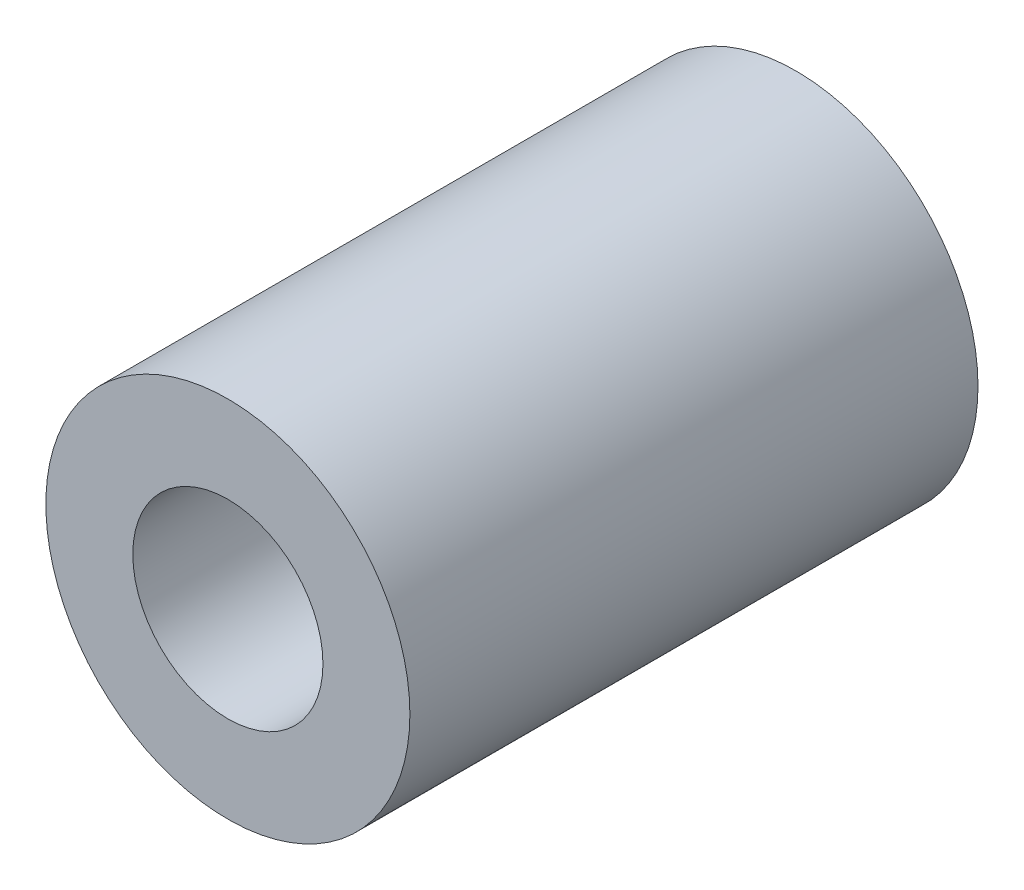
ISO-10303-21;
HEADER;
FILE_DESCRIPTION(('STEP AP214'),'2;1');
FILE_NAME('part.step','',(''),(''),'','','');
FILE_SCHEMA(('AUTOMOTIVE_DESIGN { 1 0 10303 214 1 1 1 1 }'));
ENDSEC;
DATA;
#1=APPLICATION_CONTEXT('core data for automotive mechanical design processes');
#2=APPLICATION_PROTOCOL_DEFINITION('international standard','automotive_design',2000,#1);
#3=PRODUCT_CONTEXT('',#1,'mechanical');
#4=PRODUCT('Part','Part','',(#3));
#5=PRODUCT_RELATED_PRODUCT_CATEGORY('part','',(#4));
#6=PRODUCT_DEFINITION_FORMATION('','',#4);
#7=PRODUCT_DEFINITION_CONTEXT('part definition',#1,'design');
#8=PRODUCT_DEFINITION('design','',#6,#7);
#9=PRODUCT_DEFINITION_SHAPE('','',#8);
#10=(LENGTH_UNIT() NAMED_UNIT(*) SI_UNIT(.MILLI.,.METRE.));
#11=(NAMED_UNIT(*) PLANE_ANGLE_UNIT() SI_UNIT($,.RADIAN.));
#12=(NAMED_UNIT(*) SI_UNIT($,.STERADIAN.) SOLID_ANGLE_UNIT());
#13=UNCERTAINTY_MEASURE_WITH_UNIT(LENGTH_MEASURE(1.E-05),#10,'distance_accuracy_value','');
#14=(GEOMETRIC_REPRESENTATION_CONTEXT(3) GLOBAL_UNCERTAINTY_ASSIGNED_CONTEXT((#13)) GLOBAL_UNIT_ASSIGNED_CONTEXT((#10,
#11,#12)) REPRESENTATION_CONTEXT('',''));
#15=CARTESIAN_POINT('',(0.,0.,0.));
#16=DIRECTION('',(0.,0.,1.));
#17=DIRECTION('',(1.,0.,0.));
#18=AXIS2_PLACEMENT_3D('',#15,#16,#17);
#19=CARTESIAN_POINT('',(0.,0.,24.5));
#20=DIRECTION('',(0.,0.,1.));
#21=DIRECTION('',(1.,0.,0.));
#22=AXIS2_PLACEMENT_3D('',#19,#20,#21);
#23=PLANE('',#22);
#24=CARTESIAN_POINT('',(0.,0.,24.5));
#25=DIRECTION('',(0.,0.,1.));
#26=DIRECTION('',(1.,0.,0.));
#27=AXIS2_PLACEMENT_3D('',#24,#25,#26);
#28=CIRCLE('',#27,7.85);
#29=CARTESIAN_POINT('',(7.85,0.,24.5));
#30=VERTEX_POINT('',#29);
#31=EDGE_CURVE('E10',#30,#30,#28,.T.);
#32=ORIENTED_EDGE('',*,*,#31,.T.);
#33=EDGE_LOOP('',(#32));
#34=FACE_BOUND('',#33,.T.);
#35=CARTESIAN_POINT('',(0.,0.,24.5));
#36=DIRECTION('',(0.,0.,1.));
#37=DIRECTION('',(1.,0.,0.));
#38=AXIS2_PLACEMENT_3D('',#35,#36,#37);
#39=CIRCLE('',#38,4.1);
#40=CARTESIAN_POINT('',(4.1,0.,24.5));
#41=VERTEX_POINT('',#40);
#42=EDGE_CURVE('E41',#41,#41,#39,.T.);
#43=ORIENTED_EDGE('',*,*,#42,.F.);
#44=EDGE_LOOP('',(#43));
#45=FACE_BOUND('',#44,.T.);
#46=ADVANCED_FACE('F30',(#34,#45),#23,.T.);
#47=CARTESIAN_POINT('',(0.,0.,0.));
#48=DIRECTION('',(0.,0.,1.));
#49=DIRECTION('',(1.,0.,0.));
#50=AXIS2_PLACEMENT_3D('',#47,#48,#49);
#51=PLANE('',#50);
#52=CARTESIAN_POINT('',(0.,0.,0.));
#53=DIRECTION('',(0.,0.,1.));
#54=DIRECTION('',(1.,0.,0.));
#55=AXIS2_PLACEMENT_3D('',#52,#53,#54);
#56=CIRCLE('',#55,7.85);
#57=CARTESIAN_POINT('',(7.85,0.,0.));
#58=VERTEX_POINT('',#57);
#59=EDGE_CURVE('E34',#58,#58,#56,.T.);
#60=ORIENTED_EDGE('',*,*,#59,.F.);
#61=EDGE_LOOP('',(#60));
#62=FACE_BOUND('',#61,.T.);
#63=CARTESIAN_POINT('',(0.,0.,0.));
#64=DIRECTION('',(0.,0.,1.));
#65=DIRECTION('',(1.,0.,0.));
#66=AXIS2_PLACEMENT_3D('',#63,#64,#65);
#67=CIRCLE('',#66,4.1);
#68=CARTESIAN_POINT('',(4.1,0.,0.));
#69=VERTEX_POINT('',#68);
#70=EDGE_CURVE('E43',#69,#69,#67,.T.);
#71=ORIENTED_EDGE('',*,*,#70,.T.);
#72=EDGE_LOOP('',(#71));
#73=FACE_BOUND('',#72,.T.);
#74=ADVANCED_FACE('F53',(#62,#73),#51,.F.);
#75=CARTESIAN_POINT('',(0.,0.,24.5));
#76=DIRECTION('',(0.,0.,-1.));
#77=DIRECTION('',(-1.,0.,0.));
#78=AXIS2_PLACEMENT_3D('',#75,#76,#77);
#79=CYLINDRICAL_SURFACE('',#78,7.85);
#80=ORIENTED_EDGE('',*,*,#31,.F.);
#81=EDGE_LOOP('',(#80));
#82=FACE_BOUND('',#81,.T.);
#83=ORIENTED_EDGE('',*,*,#59,.T.);
#84=EDGE_LOOP('',(#83));
#85=FACE_BOUND('',#84,.T.);
#86=ADVANCED_FACE('F32',(#82,#85),#79,.T.);
#87=CARTESIAN_POINT('',(0.,0.,24.5));
#88=DIRECTION('',(0.,0.,-1.));
#89=DIRECTION('',(-1.,0.,0.));
#90=AXIS2_PLACEMENT_3D('',#87,#88,#89);
#91=CYLINDRICAL_SURFACE('',#90,4.1);
#92=ORIENTED_EDGE('',*,*,#42,.T.);
#93=EDGE_LOOP('',(#92));
#94=FACE_BOUND('',#93,.T.);
#95=ORIENTED_EDGE('',*,*,#70,.F.);
#96=EDGE_LOOP('',(#95));
#97=FACE_BOUND('',#96,.T.);
#98=ADVANCED_FACE('F49',(#94,#97),#91,.F.);
#99=CLOSED_SHELL('',(#46,#74,#86,#98));
#100=MANIFOLD_SOLID_BREP('B2',#99);
#101=ADVANCED_BREP_SHAPE_REPRESENTATION('',(#18,#100),#14);
#102=SHAPE_DEFINITION_REPRESENTATION(#9,#101);
ENDSEC;
END-ISO-10303-21;
